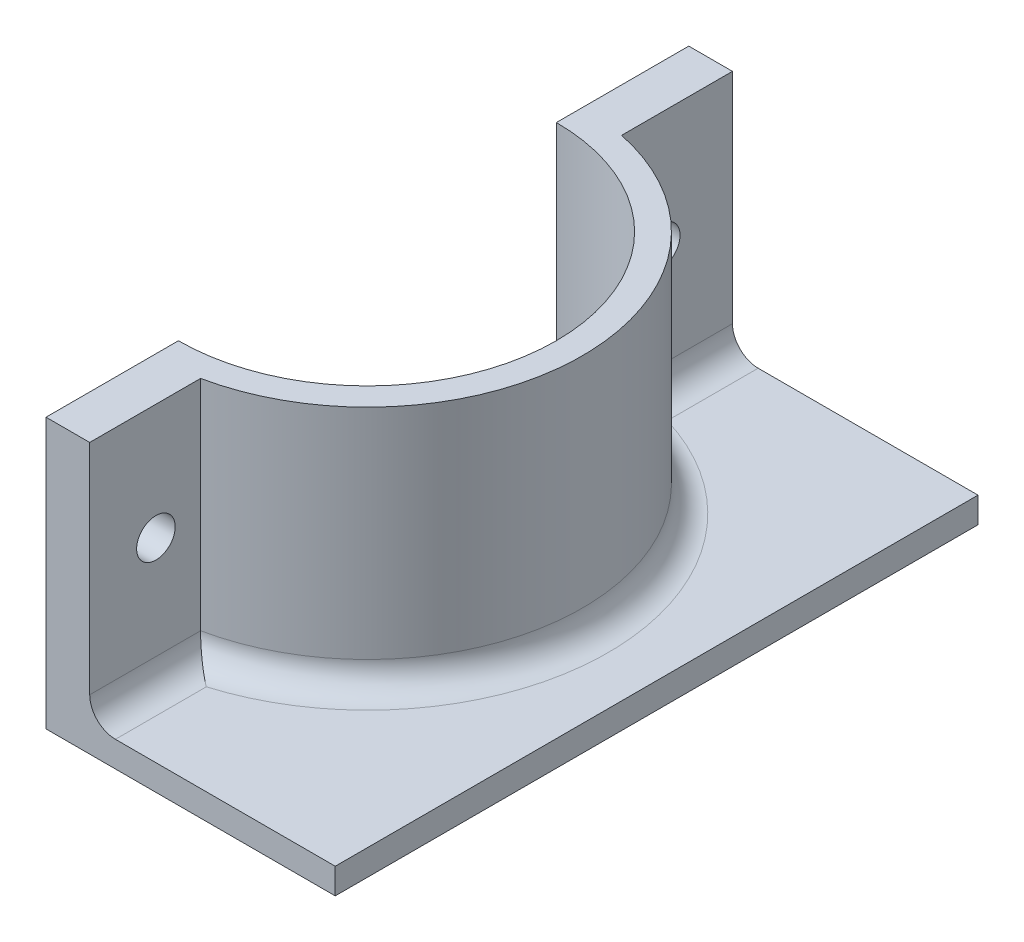
ISO-10303-21;
HEADER;
FILE_DESCRIPTION(('STEP AP214'),'2;1');
FILE_NAME('part.step','',(''),(''),'','','');
FILE_SCHEMA(('AUTOMOTIVE_DESIGN { 1 0 10303 214 1 1 1 1 }'));
ENDSEC;
DATA;
#1=APPLICATION_CONTEXT('core data for automotive mechanical design processes');
#2=APPLICATION_PROTOCOL_DEFINITION('international standard','automotive_design',2000,#1);
#3=PRODUCT_CONTEXT('',#1,'mechanical');
#4=PRODUCT('Part','Part','',(#3));
#5=PRODUCT_RELATED_PRODUCT_CATEGORY('part','',(#4));
#6=PRODUCT_DEFINITION_FORMATION('','',#4);
#7=PRODUCT_DEFINITION_CONTEXT('part definition',#1,'design');
#8=PRODUCT_DEFINITION('design','',#6,#7);
#9=PRODUCT_DEFINITION_SHAPE('','',#8);
#10=(LENGTH_UNIT() NAMED_UNIT(*) SI_UNIT(.MILLI.,.METRE.));
#11=(NAMED_UNIT(*) PLANE_ANGLE_UNIT() SI_UNIT($,.RADIAN.));
#12=(NAMED_UNIT(*) SI_UNIT($,.STERADIAN.) SOLID_ANGLE_UNIT());
#13=UNCERTAINTY_MEASURE_WITH_UNIT(LENGTH_MEASURE(1.E-05),#10,'distance_accuracy_value','');
#14=(GEOMETRIC_REPRESENTATION_CONTEXT(3) GLOBAL_UNCERTAINTY_ASSIGNED_CONTEXT((#13)) GLOBAL_UNIT_ASSIGNED_CONTEXT((#10,
#11,#12)) REPRESENTATION_CONTEXT('',''));
#15=CARTESIAN_POINT('',(0.,0.,0.));
#16=DIRECTION('',(0.,0.,1.));
#17=DIRECTION('',(1.,0.,0.));
#18=AXIS2_PLACEMENT_3D('',#15,#16,#17);
#19=CARTESIAN_POINT('',(32.893,26.67,0.));
#20=DIRECTION('',(-1.,0.,0.));
#21=DIRECTION('',(0.,0.,1.));
#22=AXIS2_PLACEMENT_3D('',#19,#20,#21);
#23=PLANE('',#22);
#24=CARTESIAN_POINT('',(32.893,15.24,-6.5405));
#25=DIRECTION('',(-1.,0.,0.));
#26=DIRECTION('',(0.,0.,1.));
#27=AXIS2_PLACEMENT_3D('',#24,#25,#26);
#28=CIRCLE('',#27,1.905);
#29=CARTESIAN_POINT('',(32.893,15.24,-4.6355));
#30=VERTEX_POINT('',#29);
#31=EDGE_CURVE('E342',#30,#30,#28,.F.);
#32=ORIENTED_EDGE('',*,*,#31,.F.);
#33=EDGE_LOOP('',(#32));
#34=FACE_BOUND('',#33,.T.);
#35=DIRECTION('',(0.,-1.,0.));
#36=VECTOR('',#35,1.);
#37=CARTESIAN_POINT('',(32.893,26.67,0.));
#38=LINE('',#37,#36);
#39=CARTESIAN_POINT('',(32.893,26.67,0.));
#40=VERTEX_POINT('',#39);
#41=CARTESIAN_POINT('',(32.893,5.08,0.));
#42=VERTEX_POINT('',#41);
#43=EDGE_CURVE('E202',#40,#42,#38,.T.);
#44=ORIENTED_EDGE('',*,*,#43,.T.);
#45=DIRECTION('',(0.,0.,-1.));
#46=VECTOR('',#45,1.);
#47=CARTESIAN_POINT('',(32.893,5.08,0.));
#48=LINE('',#47,#46);
#49=CARTESIAN_POINT('',(32.893,5.08,-10.9533864535593));
#50=VERTEX_POINT('',#49);
#51=EDGE_CURVE('E69',#42,#50,#48,.T.);
#52=ORIENTED_EDGE('',*,*,#51,.T.);
#53=DIRECTION('',(0.,-1.,0.));
#54=VECTOR('',#53,1.);
#55=CARTESIAN_POINT('',(32.893,26.67,-10.9533864535593));
#56=LINE('',#55,#54);
#57=CARTESIAN_POINT('',(32.893,26.67,-10.9533864535593));
#58=VERTEX_POINT('',#57);
#59=EDGE_CURVE('E238',#58,#50,#56,.T.);
#60=ORIENTED_EDGE('',*,*,#59,.F.);
#61=DIRECTION('',(0.,0.,-1.));
#62=VECTOR('',#61,1.);
#63=CARTESIAN_POINT('',(32.893,26.67,0.));
#64=LINE('',#63,#62);
#65=EDGE_CURVE('E175',#40,#58,#64,.T.);
#66=ORIENTED_EDGE('',*,*,#65,.F.);
#67=EDGE_LOOP('',(#44,#52,#60,#66));
#68=FACE_BOUND('',#67,.T.);
#69=ADVANCED_FACE('F45',(#34,#68),#23,.F.);
#70=CARTESIAN_POINT('',(28.575,26.67,-31.75));
#71=DIRECTION('',(0.,-1.,0.));
#72=DIRECTION('',(0.,0.,-1.));
#73=AXIS2_PLACEMENT_3D('',#70,#71,#72);
#74=CYLINDRICAL_SURFACE('',#73,21.2401567555421);
#75=ORIENTED_EDGE('',*,*,#59,.T.);
#76=CARTESIAN_POINT('',(28.575,5.08,-31.75));
#77=DIRECTION('',(0.,1.,0.));
#78=DIRECTION('',(0.,0.,1.));
#79=AXIS2_PLACEMENT_3D('',#76,#77,#78);
#80=CIRCLE('',#79,21.2401567555421);
#81=CARTESIAN_POINT('',(32.893,5.08,-52.5466135464407));
#82=VERTEX_POINT('',#81);
#83=EDGE_CURVE('E253',#50,#82,#80,.T.);
#84=ORIENTED_EDGE('',*,*,#83,.T.);
#85=DIRECTION('',(0.,-1.,0.));
#86=VECTOR('',#85,1.);
#87=CARTESIAN_POINT('',(32.893,26.67,-52.5466135464407));
#88=LINE('',#87,#86);
#89=CARTESIAN_POINT('',(32.893,26.67,-52.5466135464407));
#90=VERTEX_POINT('',#89);
#91=EDGE_CURVE('E234',#90,#82,#88,.T.);
#92=ORIENTED_EDGE('',*,*,#91,.F.);
#93=CARTESIAN_POINT('',(28.575,26.67,-31.75));
#94=DIRECTION('',(0.,1.,0.));
#95=DIRECTION('',(0.,0.,1.));
#96=AXIS2_PLACEMENT_3D('',#93,#94,#95);
#97=CIRCLE('',#96,21.2401567555421);
#98=EDGE_CURVE('E179',#58,#90,#97,.T.);
#99=ORIENTED_EDGE('',*,*,#98,.F.);
#100=EDGE_LOOP('',(#75,#84,#92,#99));
#101=FACE_BOUND('',#100,.T.);
#102=ADVANCED_FACE('F291',(#101),#74,.T.);
#103=CARTESIAN_POINT('',(32.893,26.67,0.));
#104=DIRECTION('',(1.,0.,0.));
#105=DIRECTION('',(0.,0.,-1.));
#106=AXIS2_PLACEMENT_3D('',#103,#104,#105);
#107=PLANE('',#106);
#108=CARTESIAN_POINT('',(32.893,15.24,-56.417624590122));
#109=DIRECTION('',(1.,0.,0.));
#110=DIRECTION('',(0.,0.,-1.));
#111=AXIS2_PLACEMENT_3D('',#108,#109,#110);
#112=CIRCLE('',#111,1.905);
#113=CARTESIAN_POINT('',(32.893,15.24,-58.322624590122));
#114=VERTEX_POINT('',#113);
#115=EDGE_CURVE('E268',#114,#114,#112,.F.);
#116=ORIENTED_EDGE('',*,*,#115,.T.);
#117=EDGE_LOOP('',(#116));
#118=FACE_BOUND('',#117,.T.);
#119=ORIENTED_EDGE('',*,*,#91,.T.);
#120=DIRECTION('',(0.,0.,1.));
#121=VECTOR('',#120,1.);
#122=CARTESIAN_POINT('',(32.893,5.08,-63.5));
#123=LINE('',#122,#121);
#124=CARTESIAN_POINT('',(32.893,5.08,-63.5));
#125=VERTEX_POINT('',#124);
#126=EDGE_CURVE('E250',#82,#125,#123,.F.);
#127=ORIENTED_EDGE('',*,*,#126,.T.);
#128=DIRECTION('',(0.,-1.,0.));
#129=VECTOR('',#128,1.);
#130=CARTESIAN_POINT('',(32.893,26.67,-63.5));
#131=LINE('',#130,#129);
#132=CARTESIAN_POINT('',(32.893,26.67,-63.5));
#133=VERTEX_POINT('',#132);
#134=EDGE_CURVE('E230',#133,#125,#131,.T.);
#135=ORIENTED_EDGE('',*,*,#134,.F.);
#136=DIRECTION('',(0.,0.,1.));
#137=VECTOR('',#136,1.);
#138=CARTESIAN_POINT('',(32.893,26.67,0.));
#139=LINE('',#138,#137);
#140=EDGE_CURVE('E182',#133,#90,#139,.T.);
#141=ORIENTED_EDGE('',*,*,#140,.T.);
#142=EDGE_LOOP('',(#119,#127,#135,#141));
#143=FACE_BOUND('',#142,.T.);
#144=ADVANCED_FACE('F296',(#118,#143),#107,.T.);
#145=CARTESIAN_POINT('',(0.,26.67,-63.5));
#146=DIRECTION('',(0.,0.,-1.));
#147=DIRECTION('',(-1.,0.,0.));
#148=AXIS2_PLACEMENT_3D('',#145,#146,#147);
#149=PLANE('',#148);
#150=DIRECTION('',(1.,0.,0.));
#151=VECTOR('',#150,1.);
#152=CARTESIAN_POINT('',(0.,0.,-63.5));
#153=LINE('',#152,#151);
#154=CARTESIAN_POINT('',(28.575,0.,-63.5));
#155=VERTEX_POINT('',#154);
#156=CARTESIAN_POINT('',(57.15,0.,-63.5));
#157=VERTEX_POINT('',#156);
#158=EDGE_CURVE('E147',#155,#157,#153,.T.);
#159=ORIENTED_EDGE('',*,*,#158,.F.);
#160=DIRECTION('',(0.,-1.,0.));
#161=VECTOR('',#160,1.);
#162=CARTESIAN_POINT('',(28.575,26.67,-63.5));
#163=LINE('',#162,#161);
#164=CARTESIAN_POINT('',(28.575,26.67,-63.5));
#165=VERTEX_POINT('',#164);
#166=EDGE_CURVE('E227',#165,#155,#163,.T.);
#167=ORIENTED_EDGE('',*,*,#166,.F.);
#168=DIRECTION('',(1.,0.,0.));
#169=VECTOR('',#168,1.);
#170=CARTESIAN_POINT('',(0.,26.67,-63.5));
#171=LINE('',#170,#169);
#172=EDGE_CURVE('E186',#165,#133,#171,.T.);
#173=ORIENTED_EDGE('',*,*,#172,.T.);
#174=ORIENTED_EDGE('',*,*,#134,.T.);
#175=CARTESIAN_POINT('',(35.433,5.08,-63.5));
#176=DIRECTION('',(0.,0.,-1.));
#177=DIRECTION('',(-1.,0.,0.));
#178=AXIS2_PLACEMENT_3D('',#175,#176,#177);
#179=CIRCLE('',#178,2.54);
#180=CARTESIAN_POINT('',(35.433,2.54,-63.5));
#181=VERTEX_POINT('',#180);
#182=EDGE_CURVE('E56',#125,#181,#179,.F.);
#183=ORIENTED_EDGE('',*,*,#182,.T.);
#184=DIRECTION('',(1.,0.,0.));
#185=VECTOR('',#184,1.);
#186=CARTESIAN_POINT('',(0.,2.54,-63.5));
#187=LINE('',#186,#185);
#188=CARTESIAN_POINT('',(57.15,2.54,-63.5));
#189=VERTEX_POINT('',#188);
#190=EDGE_CURVE('E164',#181,#189,#187,.T.);
#191=ORIENTED_EDGE('',*,*,#190,.T.);
#192=DIRECTION('',(0.,-1.,0.));
#193=VECTOR('',#192,1.);
#194=CARTESIAN_POINT('',(57.15,2.54,-63.5));
#195=LINE('',#194,#193);
#196=EDGE_CURVE('E148',#189,#157,#195,.T.);
#197=ORIENTED_EDGE('',*,*,#196,.T.);
#198=EDGE_LOOP('',(#159,#167,#173,#174,#183,#191,#197));
#199=FACE_BOUND('',#198,.T.);
#200=ADVANCED_FACE('F303',(#199),#149,.T.);
#201=CARTESIAN_POINT('',(28.575,26.67,0.));
#202=DIRECTION('',(1.,0.,0.));
#203=DIRECTION('',(0.,0.,-1.));
#204=AXIS2_PLACEMENT_3D('',#201,#202,#203);
#205=PLANE('',#204);
#206=CARTESIAN_POINT('',(28.575,15.24,-56.417624590122));
#207=DIRECTION('',(1.,0.,0.));
#208=DIRECTION('',(0.,0.,-1.));
#209=AXIS2_PLACEMENT_3D('',#206,#207,#208);
#210=CIRCLE('',#209,1.905);
#211=CARTESIAN_POINT('',(28.575,15.24,-58.322624590122));
#212=VERTEX_POINT('',#211);
#213=EDGE_CURVE('E50',#212,#212,#210,.F.);
#214=ORIENTED_EDGE('',*,*,#213,.F.);
#215=EDGE_LOOP('',(#214));
#216=FACE_BOUND('',#215,.T.);
#217=DIRECTION('',(0.,0.,1.));
#218=VECTOR('',#217,1.);
#219=CARTESIAN_POINT('',(28.575,0.,0.));
#220=LINE('',#219,#218);
#221=CARTESIAN_POINT('',(28.575,0.,-50.419));
#222=VERTEX_POINT('',#221);
#223=EDGE_CURVE('E205',#155,#222,#220,.T.);
#224=ORIENTED_EDGE('',*,*,#223,.T.);
#225=DIRECTION('',(0.,-1.,0.));
#226=VECTOR('',#225,1.);
#227=CARTESIAN_POINT('',(28.575,26.67,-50.419));
#228=LINE('',#227,#226);
#229=CARTESIAN_POINT('',(28.575,26.67,-50.419));
#230=VERTEX_POINT('',#229);
#231=EDGE_CURVE('E224',#230,#222,#228,.T.);
#232=ORIENTED_EDGE('',*,*,#231,.F.);
#233=DIRECTION('',(0.,0.,1.));
#234=VECTOR('',#233,1.);
#235=CARTESIAN_POINT('',(28.575,26.67,0.));
#236=LINE('',#235,#234);
#237=EDGE_CURVE('E190',#165,#230,#236,.T.);
#238=ORIENTED_EDGE('',*,*,#237,.F.);
#239=ORIENTED_EDGE('',*,*,#166,.T.);
#240=EDGE_LOOP('',(#224,#232,#238,#239));
#241=FACE_BOUND('',#240,.T.);
#242=ADVANCED_FACE('F307',(#216,#241),#205,.F.);
#243=CARTESIAN_POINT('',(28.575,26.67,-31.75));
#244=DIRECTION('',(0.,-1.,0.));
#245=DIRECTION('',(0.,0.,-1.));
#246=AXIS2_PLACEMENT_3D('',#243,#244,#245);
#247=CYLINDRICAL_SURFACE('',#246,18.669);
#248=CARTESIAN_POINT('',(28.575,0.,-31.75));
#249=DIRECTION('',(0.,1.,0.));
#250=DIRECTION('',(0.,0.,1.));
#251=AXIS2_PLACEMENT_3D('',#248,#249,#250);
#252=CIRCLE('',#251,18.669);
#253=CARTESIAN_POINT('',(28.575,0.,-13.081));
#254=VERTEX_POINT('',#253);
#255=EDGE_CURVE('E209',#254,#222,#252,.T.);
#256=ORIENTED_EDGE('',*,*,#255,.F.);
#257=DIRECTION('',(0.,-1.,0.));
#258=VECTOR('',#257,1.);
#259=CARTESIAN_POINT('',(28.575,26.67,-13.081));
#260=LINE('',#259,#258);
#261=CARTESIAN_POINT('',(28.575,26.67,-13.081));
#262=VERTEX_POINT('',#261);
#263=EDGE_CURVE('E221',#262,#254,#260,.T.);
#264=ORIENTED_EDGE('',*,*,#263,.F.);
#265=CARTESIAN_POINT('',(28.575,26.67,-31.75));
#266=DIRECTION('',(0.,1.,0.));
#267=DIRECTION('',(0.,0.,1.));
#268=AXIS2_PLACEMENT_3D('',#265,#266,#267);
#269=CIRCLE('',#268,18.669);
#270=EDGE_CURVE('E193',#262,#230,#269,.T.);
#271=ORIENTED_EDGE('',*,*,#270,.T.);
#272=ORIENTED_EDGE('',*,*,#231,.T.);
#273=EDGE_LOOP('',(#256,#264,#271,#272));
#274=FACE_BOUND('',#273,.T.);
#275=ADVANCED_FACE('F309',(#274),#247,.F.);
#276=CARTESIAN_POINT('',(28.575,15.24,-6.5405));
#277=DIRECTION('',(1.,0.,0.));
#278=DIRECTION('',(0.,0.,-1.));
#279=AXIS2_PLACEMENT_3D('',#276,#277,#278);
#280=CIRCLE('',#279,1.905);
#281=CARTESIAN_POINT('',(28.575,15.24,-8.4455));
#282=VERTEX_POINT('',#281);
#283=EDGE_CURVE('E346',#282,#282,#280,.F.);
#284=ORIENTED_EDGE('',*,*,#283,.F.);
#285=EDGE_LOOP('',(#284));
#286=FACE_BOUND('',#285,.T.);
#287=CARTESIAN_POINT('',(28.575,0.,0.));
#288=VERTEX_POINT('',#287);
#289=EDGE_CURVE('E210',#254,#288,#220,.T.);
#290=ORIENTED_EDGE('',*,*,#289,.T.);
#291=DIRECTION('',(0.,-1.,0.));
#292=VECTOR('',#291,1.);
#293=CARTESIAN_POINT('',(28.575,26.67,0.));
#294=LINE('',#293,#292);
#295=CARTESIAN_POINT('',(28.575,26.67,0.));
#296=VERTEX_POINT('',#295);
#297=EDGE_CURVE('E218',#296,#288,#294,.T.);
#298=ORIENTED_EDGE('',*,*,#297,.F.);
#299=EDGE_CURVE('E194',#262,#296,#236,.T.);
#300=ORIENTED_EDGE('',*,*,#299,.F.);
#301=ORIENTED_EDGE('',*,*,#263,.T.);
#302=EDGE_LOOP('',(#290,#298,#300,#301));
#303=FACE_BOUND('',#302,.T.);
#304=ADVANCED_FACE('F312',(#286,#303),#205,.F.);
#305=CARTESIAN_POINT('',(0.,26.67,0.));
#306=DIRECTION('',(0.,0.,1.));
#307=DIRECTION('',(1.,0.,0.));
#308=AXIS2_PLACEMENT_3D('',#305,#306,#307);
#309=PLANE('',#308);
#310=DIRECTION('',(-1.,0.,0.));
#311=VECTOR('',#310,1.);
#312=CARTESIAN_POINT('',(0.,0.,0.));
#313=LINE('',#312,#311);
#314=CARTESIAN_POINT('',(57.15,0.,0.));
#315=VERTEX_POINT('',#314);
#316=EDGE_CURVE('E141',#315,#288,#313,.T.);
#317=ORIENTED_EDGE('',*,*,#316,.F.);
#318=DIRECTION('',(0.,-1.,0.));
#319=VECTOR('',#318,1.);
#320=CARTESIAN_POINT('',(57.15,2.54,0.));
#321=LINE('',#320,#319);
#322=CARTESIAN_POINT('',(57.15,2.54,0.));
#323=VERTEX_POINT('',#322);
#324=EDGE_CURVE('E136',#323,#315,#321,.T.);
#325=ORIENTED_EDGE('',*,*,#324,.F.);
#326=DIRECTION('',(-1.,0.,0.));
#327=VECTOR('',#326,1.);
#328=CARTESIAN_POINT('',(0.,2.54,0.));
#329=LINE('',#328,#327);
#330=CARTESIAN_POINT('',(35.433,2.54,0.));
#331=VERTEX_POINT('',#330);
#332=EDGE_CURVE('E139',#323,#331,#329,.T.);
#333=ORIENTED_EDGE('',*,*,#332,.T.);
#334=CARTESIAN_POINT('',(35.433,5.08,0.));
#335=DIRECTION('',(0.,0.,1.));
#336=DIRECTION('',(1.,0.,0.));
#337=AXIS2_PLACEMENT_3D('',#334,#335,#336);
#338=CIRCLE('',#337,2.54);
#339=EDGE_CURVE('E11',#331,#42,#338,.F.);
#340=ORIENTED_EDGE('',*,*,#339,.T.);
#341=ORIENTED_EDGE('',*,*,#43,.F.);
#342=DIRECTION('',(-1.,0.,0.));
#343=VECTOR('',#342,1.);
#344=CARTESIAN_POINT('',(0.,26.67,0.));
#345=LINE('',#344,#343);
#346=EDGE_CURVE('E198',#40,#296,#345,.T.);
#347=ORIENTED_EDGE('',*,*,#346,.T.);
#348=ORIENTED_EDGE('',*,*,#297,.T.);
#349=EDGE_LOOP('',(#317,#325,#333,#340,#341,#347,#348));
#350=FACE_BOUND('',#349,.T.);
#351=ADVANCED_FACE('F138',(#350),#309,.T.);
#352=CARTESIAN_POINT('',(0.,26.67,0.));
#353=DIRECTION('',(0.,1.,0.));
#354=DIRECTION('',(0.,0.,1.));
#355=AXIS2_PLACEMENT_3D('',#352,#353,#354);
#356=PLANE('',#355);
#357=ORIENTED_EDGE('',*,*,#65,.T.);
#358=ORIENTED_EDGE('',*,*,#98,.T.);
#359=ORIENTED_EDGE('',*,*,#140,.F.);
#360=ORIENTED_EDGE('',*,*,#172,.F.);
#361=ORIENTED_EDGE('',*,*,#237,.T.);
#362=ORIENTED_EDGE('',*,*,#270,.F.);
#363=ORIENTED_EDGE('',*,*,#299,.T.);
#364=ORIENTED_EDGE('',*,*,#346,.F.);
#365=EDGE_LOOP('',(#357,#358,#359,#360,#361,#362,#363,#364));
#366=FACE_BOUND('',#365,.T.);
#367=ADVANCED_FACE('F319',(#366),#356,.T.);
#368=CARTESIAN_POINT('',(0.,0.,0.));
#369=DIRECTION('',(0.,1.,0.));
#370=DIRECTION('',(0.,0.,1.));
#371=AXIS2_PLACEMENT_3D('',#368,#369,#370);
#372=PLANE('',#371);
#373=DIRECTION('',(0.,0.,1.));
#374=VECTOR('',#373,1.);
#375=CARTESIAN_POINT('',(57.15,0.,0.));
#376=LINE('',#375,#374);
#377=EDGE_CURVE('E158',#157,#315,#376,.T.);
#378=ORIENTED_EDGE('',*,*,#377,.T.);
#379=ORIENTED_EDGE('',*,*,#316,.T.);
#380=ORIENTED_EDGE('',*,*,#289,.F.);
#381=ORIENTED_EDGE('',*,*,#255,.T.);
#382=ORIENTED_EDGE('',*,*,#223,.F.);
#383=ORIENTED_EDGE('',*,*,#158,.T.);
#384=EDGE_LOOP('',(#378,#379,#380,#381,#382,#383));
#385=FACE_BOUND('',#384,.T.);
#386=ADVANCED_FACE('F320',(#385),#372,.F.);
#387=CARTESIAN_POINT('',(57.15,2.54,0.));
#388=DIRECTION('',(1.,0.,0.));
#389=DIRECTION('',(0.,0.,-1.));
#390=AXIS2_PLACEMENT_3D('',#387,#388,#389);
#391=PLANE('',#390);
#392=ORIENTED_EDGE('',*,*,#377,.F.);
#393=ORIENTED_EDGE('',*,*,#196,.F.);
#394=DIRECTION('',(0.,0.,1.));
#395=VECTOR('',#394,1.);
#396=CARTESIAN_POINT('',(57.15,2.54,0.));
#397=LINE('',#396,#395);
#398=EDGE_CURVE('E154',#189,#323,#397,.T.);
#399=ORIENTED_EDGE('',*,*,#398,.T.);
#400=ORIENTED_EDGE('',*,*,#324,.T.);
#401=EDGE_LOOP('',(#392,#393,#399,#400));
#402=FACE_BOUND('',#401,.T.);
#403=ADVANCED_FACE('F161',(#402),#391,.T.);
#404=CARTESIAN_POINT('',(0.,2.54,0.));
#405=DIRECTION('',(0.,1.,0.));
#406=DIRECTION('',(0.,0.,1.));
#407=AXIS2_PLACEMENT_3D('',#404,#405,#406);
#408=PLANE('',#407);
#409=ORIENTED_EDGE('',*,*,#190,.F.);
#410=DIRECTION('',(0.,0.,1.));
#411=VECTOR('',#410,1.);
#412=CARTESIAN_POINT('',(35.433,2.54,-52.5466135464407));
#413=LINE('',#412,#411);
#414=CARTESIAN_POINT('',(35.433,2.54,-54.5197977882579));
#415=VERTEX_POINT('',#414);
#416=EDGE_CURVE('E246',#181,#415,#413,.T.);
#417=ORIENTED_EDGE('',*,*,#416,.T.);
#418=CARTESIAN_POINT('',(28.575,2.54,-31.75));
#419=DIRECTION('',(0.,1.,0.));
#420=DIRECTION('',(0.,0.,1.));
#421=AXIS2_PLACEMENT_3D('',#418,#419,#420);
#422=CIRCLE('',#421,23.7801567555421);
#423=CARTESIAN_POINT('',(35.433,2.54,-8.98020221174212));
#424=VERTEX_POINT('',#423);
#425=EDGE_CURVE('E243',#415,#424,#422,.F.);
#426=ORIENTED_EDGE('',*,*,#425,.T.);
#427=DIRECTION('',(0.,0.,-1.));
#428=VECTOR('',#427,1.);
#429=CARTESIAN_POINT('',(35.433,2.54,0.));
#430=LINE('',#429,#428);
#431=EDGE_CURVE('E156',#424,#331,#430,.F.);
#432=ORIENTED_EDGE('',*,*,#431,.T.);
#433=ORIENTED_EDGE('',*,*,#332,.F.);
#434=ORIENTED_EDGE('',*,*,#398,.F.);
#435=EDGE_LOOP('',(#409,#417,#426,#432,#433,#434));
#436=FACE_BOUND('',#435,.T.);
#437=ADVANCED_FACE('F153',(#436),#408,.T.);
#438=CARTESIAN_POINT('',(35.433,5.08,0.));
#439=DIRECTION('',(0.,0.,-1.));
#440=DIRECTION('',(-1.,0.,0.));
#441=AXIS2_PLACEMENT_3D('',#438,#439,#440);
#442=CYLINDRICAL_SURFACE('',#441,2.54);
#443=ORIENTED_EDGE('',*,*,#339,.F.);
#444=ORIENTED_EDGE('',*,*,#431,.F.);
#445=CARTESIAN_POINT('',(32.893,5.08,-10.9533864535593));
#446=CARTESIAN_POINT('',(32.8929868718387,5.01959786979868,-10.9533980416884));
#447=CARTESIAN_POINT('',(32.8951541564025,4.95920495446936,-10.9516336412252));
#448=CARTESIAN_POINT('',(32.9037485063561,4.83896000383438,-10.9446417234508));
#449=CARTESIAN_POINT('',(32.910173018773,4.77910766614615,-10.9394162816566));
#450=CARTESIAN_POINT('',(32.9271223503369,4.66080215984382,-10.9256386223106));
#451=CARTESIAN_POINT('',(32.9376185844954,4.60234218831224,-10.9171095977476));
#452=CARTESIAN_POINT('',(32.9625248261229,4.48683180580793,-10.8968885461002));
#453=CARTESIAN_POINT('',(32.9769352438364,4.4297815432706,-10.8851961874681));
#454=CARTESIAN_POINT('',(33.0256505246288,4.26156273822824,-10.8457110749503));
#455=CARTESIAN_POINT('',(33.0654924433693,4.15296841691072,-10.813467008867));
#456=CARTESIAN_POINT('',(33.1578524787309,3.94495640487382,-10.7389488258945));
#457=CARTESIAN_POINT('',(33.2103935452523,3.84555578387949,-10.6966565522642));
#458=CARTESIAN_POINT('',(33.3446210014449,3.62686958703568,-10.5890059634588));
#459=CARTESIAN_POINT('',(33.4302443736669,3.51148865981864,-10.520605542621));
#460=CARTESIAN_POINT('',(33.6154383887952,3.30014212100196,-10.3734941994385));
#461=CARTESIAN_POINT('',(33.7150312373507,3.204208027322,-10.2947668747924));
#462=CARTESIAN_POINT('',(33.9506199175837,3.01050400186893,-10.1096655136413));
#463=CARTESIAN_POINT('',(34.089515126737,2.91819037582433,-10.0012799484847));
#464=CARTESIAN_POINT('',(34.3781238032563,2.76361085693341,-9.77786693261951));
#465=CARTESIAN_POINT('',(34.5278418334102,2.70135772322049,-9.66283668473683));
#466=CARTESIAN_POINT('',(34.8019796207823,2.61636341372664,-9.4539061321637));
#467=CARTESIAN_POINT('',(34.9251825636637,2.5880965351175,-9.36058851869518));
#468=CARTESIAN_POINT('',(35.173781331569,2.55014523117224,-9.17347832548852));
#469=CARTESIAN_POINT('',(35.2991720559456,2.54042223276459,-9.0796871394605));
#470=CARTESIAN_POINT('',(35.4274884007547,2.54000448288766,-8.98429862050299));
#471=CARTESIAN_POINT('',(35.4302441650051,2.5399999978158,-8.98225030330887));
#472=CARTESIAN_POINT('',(35.433,2.54,-8.98020221174212));
#473=B_SPLINE_CURVE_WITH_KNOTS('',3,(#445,#446,#447,#448,#449,#450,#451,#452,#453,#454,#455,
#456,#457,#458,#459,#460,#461,#462,#463,#464,#465,#466,#467,#468,#469,#470,#471,#472),
.UNSPECIFIED.,.F.,.F.,(4,2,2,2,2,2,2,2,2,2,2,2,2,4),(0.,0.18112665586012,0.362144791923683,
0.541914464575692,0.721702986114635,1.0802015354025,1.43935287225414,1.91416192689135,
2.38973446862961,2.98336602681221,3.57724933007204,4.04758155810656,4.51693437784668,
4.52723527366927),.UNSPECIFIED.);
#474=EDGE_CURVE('E172',#50,#424,#473,.T.);
#475=ORIENTED_EDGE('',*,*,#474,.F.);
#476=ORIENTED_EDGE('',*,*,#51,.F.);
#477=EDGE_LOOP('',(#443,#444,#475,#476));
#478=FACE_BOUND('',#477,.T.);
#479=ADVANCED_FACE('F47',(#478),#442,.F.);
#480=CARTESIAN_POINT('',(28.575,5.08,-31.75));
#481=DIRECTION('',(0.,1.,0.));
#482=DIRECTION('',(0.,0.,1.));
#483=AXIS2_PLACEMENT_3D('',#480,#481,#482);
#484=TOROIDAL_SURFACE('',#483,23.7801567555421,2.54);
#485=ORIENTED_EDGE('',*,*,#474,.T.);
#486=ORIENTED_EDGE('',*,*,#425,.F.);
#487=CARTESIAN_POINT('',(32.893,5.08,-52.5466135464407));
#488=CARTESIAN_POINT('',(32.8929868718387,5.01959786979868,-52.5466019583116));
#489=CARTESIAN_POINT('',(32.8951541564025,4.95920495446935,-52.5483663587748));
#490=CARTESIAN_POINT('',(32.9037485063561,4.83896000383438,-52.5553582765492));
#491=CARTESIAN_POINT('',(32.910173018773,4.77910766614615,-52.5605837183434));
#492=CARTESIAN_POINT('',(32.9271223503369,4.66080215984382,-52.5743613776894));
#493=CARTESIAN_POINT('',(32.9376185844954,4.60234218831224,-52.5828904022524));
#494=CARTESIAN_POINT('',(32.9625248261229,4.48683180580793,-52.6031114538998));
#495=CARTESIAN_POINT('',(32.9769352438364,4.4297815432706,-52.6148038125319));
#496=CARTESIAN_POINT('',(33.0256505246288,4.26156273822825,-52.6542889250497));
#497=CARTESIAN_POINT('',(33.0654924433693,4.15296841691072,-52.686532991133));
#498=CARTESIAN_POINT('',(33.1578524787309,3.94495640487382,-52.7610511741055));
#499=CARTESIAN_POINT('',(33.2103935452523,3.84555578387949,-52.8033434477358));
#500=CARTESIAN_POINT('',(33.3446210014449,3.62686958703568,-52.9109940365412));
#501=CARTESIAN_POINT('',(33.4302443736669,3.51148865981863,-52.979394457379));
#502=CARTESIAN_POINT('',(33.6154383887952,3.30014212100196,-53.1265058005615));
#503=CARTESIAN_POINT('',(33.7150312373507,3.204208027322,-53.2052331252076));
#504=CARTESIAN_POINT('',(33.9506199175837,3.01050400186894,-53.3903344863587));
#505=CARTESIAN_POINT('',(34.089515126737,2.91819037582434,-53.4987200515152));
#506=CARTESIAN_POINT('',(34.3781238032561,2.76361085693342,-53.7221330673806));
#507=CARTESIAN_POINT('',(34.5278418334098,2.70135772322049,-53.8371633152636));
#508=CARTESIAN_POINT('',(34.8019796207826,2.61636341372664,-54.0460938678359));
#509=CARTESIAN_POINT('',(34.9251825636646,2.58809653511749,-54.1394114813036));
#510=CARTESIAN_POINT('',(35.1737813315681,2.55014523117224,-54.3265216745127));
#511=CARTESIAN_POINT('',(35.2991720559422,2.54042223276459,-54.4203128605441));
#512=CARTESIAN_POINT('',(35.4274884007545,2.54000448288766,-54.5157013794972));
#513=CARTESIAN_POINT('',(35.430244165005,2.5399999978158,-54.5177496966912));
#514=CARTESIAN_POINT('',(35.433,2.54,-54.5197977882579));
#515=B_SPLINE_CURVE_WITH_KNOTS('',3,(#487,#488,#489,#490,#491,#492,#493,#494,#495,#496,#497,
#498,#499,#500,#501,#502,#503,#504,#505,#506,#507,#508,#509,#510,#511,#512,#513,#514),
.UNSPECIFIED.,.F.,.F.,(4,2,2,2,2,2,2,2,2,2,2,2,2,4),(0.,0.181126655860121,0.362144791923685,
0.541914464575692,0.721702986114635,1.0802015354025,1.43935287225414,1.91416192689136,
2.38973446862961,2.98336602681217,3.57724933007203,4.04758155810658,4.51693437784669,
4.52723527366928),.UNSPECIFIED.);
#516=EDGE_CURVE('E260',#82,#415,#515,.T.);
#517=ORIENTED_EDGE('',*,*,#516,.F.);
#518=ORIENTED_EDGE('',*,*,#83,.F.);
#519=EDGE_LOOP('',(#485,#486,#517,#518));
#520=FACE_BOUND('',#519,.T.);
#521=ADVANCED_FACE('F273',(#520),#484,.F.);
#522=CARTESIAN_POINT('',(35.433,5.08,0.));
#523=DIRECTION('',(0.,0.,-1.));
#524=DIRECTION('',(-1.,0.,0.));
#525=AXIS2_PLACEMENT_3D('',#522,#523,#524);
#526=CYLINDRICAL_SURFACE('',#525,2.54);
#527=ORIENTED_EDGE('',*,*,#182,.F.);
#528=ORIENTED_EDGE('',*,*,#126,.F.);
#529=ORIENTED_EDGE('',*,*,#516,.T.);
#530=ORIENTED_EDGE('',*,*,#416,.F.);
#531=EDGE_LOOP('',(#527,#528,#529,#530));
#532=FACE_BOUND('',#531,.T.);
#533=ADVANCED_FACE('F276',(#532),#526,.F.);
#534=CARTESIAN_POINT('',(28.575,15.24,-6.5405));
#535=DIRECTION('',(-1.,0.,0.));
#536=DIRECTION('',(0.,0.,1.));
#537=AXIS2_PLACEMENT_3D('',#534,#535,#536);
#538=CYLINDRICAL_SURFACE('',#537,1.905);
#539=ORIENTED_EDGE('',*,*,#283,.T.);
#540=EDGE_LOOP('',(#539));
#541=FACE_BOUND('',#540,.T.);
#542=ORIENTED_EDGE('',*,*,#31,.T.);
#543=EDGE_LOOP('',(#542));
#544=FACE_BOUND('',#543,.T.);
#545=ADVANCED_FACE('F279',(#541,#544),#538,.F.);
#546=CARTESIAN_POINT('',(28.575,15.24,-56.417624590122));
#547=DIRECTION('',(-1.,0.,0.));
#548=DIRECTION('',(0.,0.,1.));
#549=AXIS2_PLACEMENT_3D('',#546,#547,#548);
#550=CYLINDRICAL_SURFACE('',#549,1.905);
#551=ORIENTED_EDGE('',*,*,#115,.F.);
#552=EDGE_LOOP('',(#551));
#553=FACE_BOUND('',#552,.T.);
#554=ORIENTED_EDGE('',*,*,#213,.T.);
#555=EDGE_LOOP('',(#554));
#556=FACE_BOUND('',#555,.T.);
#557=ADVANCED_FACE('F285',(#553,#556),#550,.F.);
#558=CLOSED_SHELL('',(#69,#102,#144,#200,#242,#275,#304,#351,#367,#386,#403,#437,#479,#521,#533,
#545,#557));
#559=MANIFOLD_SOLID_BREP('B2',#558);
#560=ADVANCED_BREP_SHAPE_REPRESENTATION('',(#18,#559),#14);
#561=SHAPE_DEFINITION_REPRESENTATION(#9,#560);
ENDSEC;
END-ISO-10303-21;
